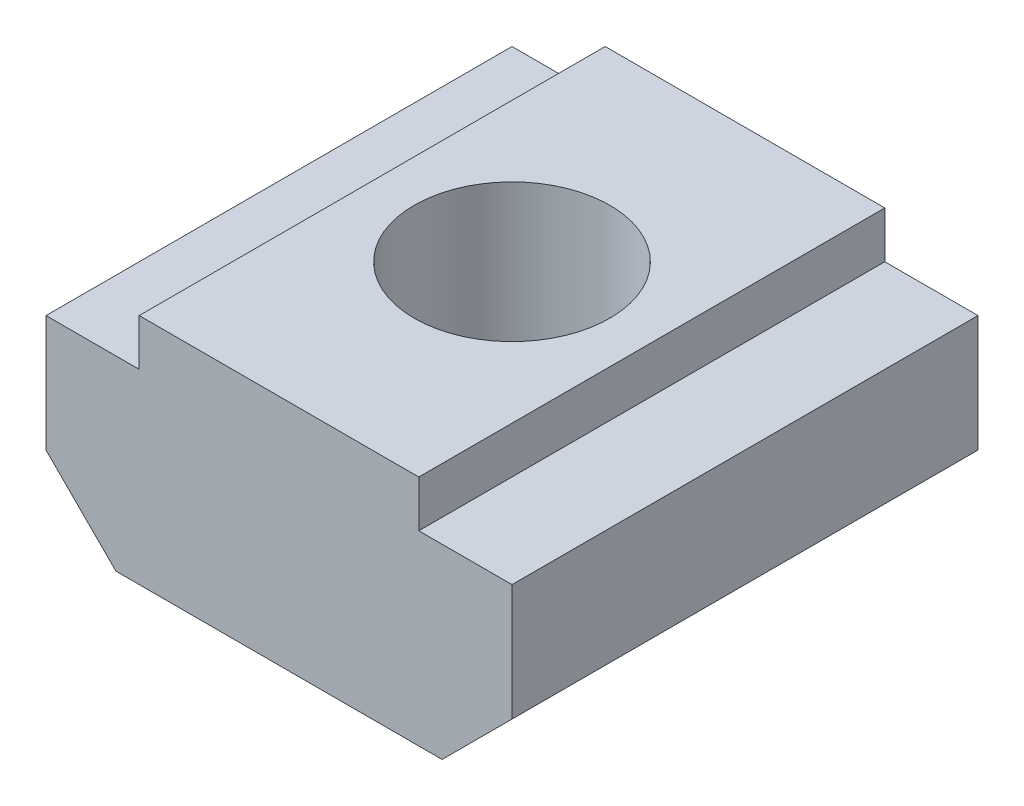
ISO-10303-21;
HEADER;
FILE_DESCRIPTION(('STEP AP214'),'2;1');
FILE_NAME('part.step','',(''),(''),'','','');
FILE_SCHEMA(('AUTOMOTIVE_DESIGN { 1 0 10303 214 1 1 1 1 }'));
ENDSEC;
DATA;
#1=APPLICATION_CONTEXT('core data for automotive mechanical design processes');
#2=APPLICATION_PROTOCOL_DEFINITION('international standard','automotive_design',2000,#1);
#3=PRODUCT_CONTEXT('',#1,'mechanical');
#4=PRODUCT('Part','Part','',(#3));
#5=PRODUCT_RELATED_PRODUCT_CATEGORY('part','',(#4));
#6=PRODUCT_DEFINITION_FORMATION('','',#4);
#7=PRODUCT_DEFINITION_CONTEXT('part definition',#1,'design');
#8=PRODUCT_DEFINITION('design','',#6,#7);
#9=PRODUCT_DEFINITION_SHAPE('','',#8);
#10=(LENGTH_UNIT() NAMED_UNIT(*) SI_UNIT(.MILLI.,.METRE.));
#11=(NAMED_UNIT(*) PLANE_ANGLE_UNIT() SI_UNIT($,.RADIAN.));
#12=(NAMED_UNIT(*) SI_UNIT($,.STERADIAN.) SOLID_ANGLE_UNIT());
#13=UNCERTAINTY_MEASURE_WITH_UNIT(LENGTH_MEASURE(1.E-05),#10,'distance_accuracy_value','');
#14=(GEOMETRIC_REPRESENTATION_CONTEXT(3) GLOBAL_UNCERTAINTY_ASSIGNED_CONTEXT((#13)) GLOBAL_UNIT_ASSIGNED_CONTEXT((#10,
#11,#12)) REPRESENTATION_CONTEXT('',''));
#15=CARTESIAN_POINT('',(0.,0.,0.));
#16=DIRECTION('',(0.,0.,1.));
#17=DIRECTION('',(1.,0.,0.));
#18=AXIS2_PLACEMENT_3D('',#15,#16,#17);
#19=CARTESIAN_POINT('',(0.,1.5,5.));
#20=DIRECTION('',(0.,1.,0.));
#21=DIRECTION('',(0.,0.,1.));
#22=AXIS2_PLACEMENT_3D('',#19,#20,#21);
#23=PLANE('',#22);
#24=DIRECTION('',(1.,0.,0.));
#25=VECTOR('',#24,1.);
#26=CARTESIAN_POINT('',(0.,1.5,-5.));
#27=LINE('',#26,#25);
#28=CARTESIAN_POINT('',(-5.,1.5,-5.));
#29=VERTEX_POINT('',#28);
#30=CARTESIAN_POINT('',(-3.,1.5,-5.));
#31=VERTEX_POINT('',#30);
#32=EDGE_CURVE('E154',#29,#31,#27,.T.);
#33=ORIENTED_EDGE('',*,*,#32,.F.);
#34=DIRECTION('',(0.,0.,-1.));
#35=VECTOR('',#34,1.);
#36=CARTESIAN_POINT('',(-5.,1.5,5.));
#37=LINE('',#36,#35);
#38=CARTESIAN_POINT('',(-5.,1.5,5.));
#39=VERTEX_POINT('',#38);
#40=EDGE_CURVE('E11',#39,#29,#37,.T.);
#41=ORIENTED_EDGE('',*,*,#40,.F.);
#42=DIRECTION('',(1.,0.,0.));
#43=VECTOR('',#42,1.);
#44=CARTESIAN_POINT('',(0.,1.5,5.));
#45=LINE('',#44,#43);
#46=CARTESIAN_POINT('',(-3.,1.5,5.));
#47=VERTEX_POINT('',#46);
#48=EDGE_CURVE('E190',#39,#47,#45,.T.);
#49=ORIENTED_EDGE('',*,*,#48,.T.);
#50=DIRECTION('',(0.,0.,-1.));
#51=VECTOR('',#50,1.);
#52=CARTESIAN_POINT('',(-3.,1.5,5.));
#53=LINE('',#52,#51);
#54=EDGE_CURVE('E62',#47,#31,#53,.T.);
#55=ORIENTED_EDGE('',*,*,#54,.T.);
#56=EDGE_LOOP('',(#33,#41,#49,#55));
#57=FACE_BOUND('',#56,.T.);
#58=ADVANCED_FACE('F45',(#57),#23,.T.);
#59=CARTESIAN_POINT('',(-5.,0.,5.));
#60=DIRECTION('',(-1.,0.,0.));
#61=DIRECTION('',(0.,0.,1.));
#62=AXIS2_PLACEMENT_3D('',#59,#60,#61);
#63=PLANE('',#62);
#64=DIRECTION('',(0.,1.,0.));
#65=VECTOR('',#64,1.);
#66=CARTESIAN_POINT('',(-5.,0.,-5.));
#67=LINE('',#66,#65);
#68=CARTESIAN_POINT('',(-5.,-1.00000000000001,-5.));
#69=VERTEX_POINT('',#68);
#70=EDGE_CURVE('E157',#69,#29,#67,.T.);
#71=ORIENTED_EDGE('',*,*,#70,.F.);
#72=DIRECTION('',(0.,0.,-1.));
#73=VECTOR('',#72,1.);
#74=CARTESIAN_POINT('',(-5.,-1.00000000000001,5.));
#75=LINE('',#74,#73);
#76=CARTESIAN_POINT('',(-5.,-1.00000000000001,5.));
#77=VERTEX_POINT('',#76);
#78=EDGE_CURVE('E54',#77,#69,#75,.T.);
#79=ORIENTED_EDGE('',*,*,#78,.F.);
#80=DIRECTION('',(0.,1.,0.));
#81=VECTOR('',#80,1.);
#82=CARTESIAN_POINT('',(-5.,0.,5.));
#83=LINE('',#82,#81);
#84=EDGE_CURVE('E224',#77,#39,#83,.T.);
#85=ORIENTED_EDGE('',*,*,#84,.T.);
#86=ORIENTED_EDGE('',*,*,#40,.T.);
#87=EDGE_LOOP('',(#71,#79,#85,#86));
#88=FACE_BOUND('',#87,.T.);
#89=ADVANCED_FACE('F223',(#88),#63,.T.);
#90=CARTESIAN_POINT('',(-2.99999999999998,-3.00000000000001,5.));
#91=DIRECTION('',(0.707106781186544,0.707106781186551,0.));
#92=DIRECTION('',(-0.707106781186551,0.707106781186544,0.));
#93=AXIS2_PLACEMENT_3D('',#90,#91,#92);
#94=PLANE('',#93);
#95=DIRECTION('',(0.707106781186551,-0.707106781186544,0.));
#96=VECTOR('',#95,1.);
#97=CARTESIAN_POINT('',(-2.99999999999998,-3.00000000000001,-5.));
#98=LINE('',#97,#96);
#99=CARTESIAN_POINT('',(-3.5,-2.5,-5.));
#100=VERTEX_POINT('',#99);
#101=EDGE_CURVE('E162',#69,#100,#98,.T.);
#102=ORIENTED_EDGE('',*,*,#101,.T.);
#103=DIRECTION('',(0.,0.,-1.));
#104=VECTOR('',#103,1.);
#105=CARTESIAN_POINT('',(-3.5,-2.5,5.));
#106=LINE('',#105,#104);
#107=CARTESIAN_POINT('',(-3.5,-2.5,5.));
#108=VERTEX_POINT('',#107);
#109=EDGE_CURVE('E206',#108,#100,#106,.T.);
#110=ORIENTED_EDGE('',*,*,#109,.F.);
#111=DIRECTION('',(0.707106781186551,-0.707106781186544,0.));
#112=VECTOR('',#111,1.);
#113=CARTESIAN_POINT('',(-2.99999999999998,-3.00000000000001,5.));
#114=LINE('',#113,#112);
#115=EDGE_CURVE('E215',#77,#108,#114,.T.);
#116=ORIENTED_EDGE('',*,*,#115,.F.);
#117=ORIENTED_EDGE('',*,*,#78,.T.);
#118=EDGE_LOOP('',(#102,#110,#116,#117));
#119=FACE_BOUND('',#118,.T.);
#120=ADVANCED_FACE('F213',(#119),#94,.F.);
#121=CARTESIAN_POINT('',(0.,-2.5,5.));
#122=DIRECTION('',(0.,1.,0.));
#123=DIRECTION('',(0.,0.,1.));
#124=AXIS2_PLACEMENT_3D('',#121,#122,#123);
#125=PLANE('',#124);
#126=CARTESIAN_POINT('',(0.,-2.5,0.));
#127=DIRECTION('',(0.,1.,0.));
#128=DIRECTION('',(0.,0.,1.));
#129=AXIS2_PLACEMENT_3D('',#126,#127,#128);
#130=CIRCLE('',#129,2.1);
#131=CARTESIAN_POINT('',(0.,-2.5,2.1));
#132=VERTEX_POINT('',#131);
#133=EDGE_CURVE('E158',#132,#132,#130,.T.);
#134=ORIENTED_EDGE('',*,*,#133,.T.);
#135=EDGE_LOOP('',(#134));
#136=FACE_BOUND('',#135,.T.);
#137=DIRECTION('',(1.,0.,0.));
#138=VECTOR('',#137,1.);
#139=CARTESIAN_POINT('',(0.,-2.5,-5.));
#140=LINE('',#139,#138);
#141=CARTESIAN_POINT('',(3.5,-2.5,-5.));
#142=VERTEX_POINT('',#141);
#143=EDGE_CURVE('E165',#100,#142,#140,.T.);
#144=ORIENTED_EDGE('',*,*,#143,.T.);
#145=DIRECTION('',(0.,0.,-1.));
#146=VECTOR('',#145,1.);
#147=CARTESIAN_POINT('',(3.5,-2.5,5.));
#148=LINE('',#147,#146);
#149=CARTESIAN_POINT('',(3.5,-2.5,5.));
#150=VERTEX_POINT('',#149);
#151=EDGE_CURVE('E203',#150,#142,#148,.T.);
#152=ORIENTED_EDGE('',*,*,#151,.F.);
#153=DIRECTION('',(1.,0.,0.));
#154=VECTOR('',#153,1.);
#155=CARTESIAN_POINT('',(0.,-2.5,5.));
#156=LINE('',#155,#154);
#157=EDGE_CURVE('E403',#108,#150,#156,.T.);
#158=ORIENTED_EDGE('',*,*,#157,.F.);
#159=ORIENTED_EDGE('',*,*,#109,.T.);
#160=EDGE_LOOP('',(#144,#152,#158,#159));
#161=FACE_BOUND('',#160,.T.);
#162=ADVANCED_FACE('F243',(#136,#161),#125,.F.);
#163=CARTESIAN_POINT('',(2.99999999999998,-3.00000000000001,5.));
#164=DIRECTION('',(0.707106781186544,-0.707106781186551,0.));
#165=DIRECTION('',(0.707106781186551,0.707106781186544,0.));
#166=AXIS2_PLACEMENT_3D('',#163,#164,#165);
#167=PLANE('',#166);
#168=DIRECTION('',(-0.707106781186551,-0.707106781186544,0.));
#169=VECTOR('',#168,1.);
#170=CARTESIAN_POINT('',(2.99999999999998,-3.00000000000001,-5.));
#171=LINE('',#170,#169);
#172=CARTESIAN_POINT('',(5.,-1.00000000000001,-5.));
#173=VERTEX_POINT('',#172);
#174=EDGE_CURVE('E169',#173,#142,#171,.T.);
#175=ORIENTED_EDGE('',*,*,#174,.F.);
#176=DIRECTION('',(0.,0.,-1.));
#177=VECTOR('',#176,1.);
#178=CARTESIAN_POINT('',(5.,-1.00000000000001,5.));
#179=LINE('',#178,#177);
#180=CARTESIAN_POINT('',(5.,-1.00000000000001,5.));
#181=VERTEX_POINT('',#180);
#182=EDGE_CURVE('E200',#181,#173,#179,.T.);
#183=ORIENTED_EDGE('',*,*,#182,.F.);
#184=DIRECTION('',(-0.707106781186551,-0.707106781186544,0.));
#185=VECTOR('',#184,1.);
#186=CARTESIAN_POINT('',(2.99999999999998,-3.00000000000001,5.));
#187=LINE('',#186,#185);
#188=EDGE_CURVE('E406',#181,#150,#187,.T.);
#189=ORIENTED_EDGE('',*,*,#188,.T.);
#190=ORIENTED_EDGE('',*,*,#151,.T.);
#191=EDGE_LOOP('',(#175,#183,#189,#190));
#192=FACE_BOUND('',#191,.T.);
#193=ADVANCED_FACE('F248',(#192),#167,.T.);
#194=CARTESIAN_POINT('',(5.,0.,5.));
#195=DIRECTION('',(-1.,0.,0.));
#196=DIRECTION('',(0.,0.,1.));
#197=AXIS2_PLACEMENT_3D('',#194,#195,#196);
#198=PLANE('',#197);
#199=DIRECTION('',(0.,1.,0.));
#200=VECTOR('',#199,1.);
#201=CARTESIAN_POINT('',(5.,0.,-5.));
#202=LINE('',#201,#200);
#203=CARTESIAN_POINT('',(5.,1.5,-5.));
#204=VERTEX_POINT('',#203);
#205=EDGE_CURVE('E173',#173,#204,#202,.T.);
#206=ORIENTED_EDGE('',*,*,#205,.T.);
#207=DIRECTION('',(0.,0.,-1.));
#208=VECTOR('',#207,1.);
#209=CARTESIAN_POINT('',(5.,1.5,5.));
#210=LINE('',#209,#208);
#211=CARTESIAN_POINT('',(5.,1.5,5.));
#212=VERTEX_POINT('',#211);
#213=EDGE_CURVE('E197',#212,#204,#210,.T.);
#214=ORIENTED_EDGE('',*,*,#213,.F.);
#215=DIRECTION('',(0.,1.,0.));
#216=VECTOR('',#215,1.);
#217=CARTESIAN_POINT('',(5.,0.,5.));
#218=LINE('',#217,#216);
#219=EDGE_CURVE('E410',#181,#212,#218,.T.);
#220=ORIENTED_EDGE('',*,*,#219,.F.);
#221=ORIENTED_EDGE('',*,*,#182,.T.);
#222=EDGE_LOOP('',(#206,#214,#220,#221));
#223=FACE_BOUND('',#222,.T.);
#224=ADVANCED_FACE('F252',(#223),#198,.F.);
#225=CARTESIAN_POINT('',(0.,1.5,5.));
#226=DIRECTION('',(0.,1.,0.));
#227=DIRECTION('',(0.,0.,1.));
#228=AXIS2_PLACEMENT_3D('',#225,#226,#227);
#229=PLANE('',#228);
#230=DIRECTION('',(1.,0.,0.));
#231=VECTOR('',#230,1.);
#232=CARTESIAN_POINT('',(0.,1.5,-5.));
#233=LINE('',#232,#231);
#234=CARTESIAN_POINT('',(3.,1.5,-5.));
#235=VERTEX_POINT('',#234);
#236=EDGE_CURVE('E177',#235,#204,#233,.T.);
#237=ORIENTED_EDGE('',*,*,#236,.F.);
#238=DIRECTION('',(0.,0.,-1.));
#239=VECTOR('',#238,1.);
#240=CARTESIAN_POINT('',(3.,1.5,5.));
#241=LINE('',#240,#239);
#242=CARTESIAN_POINT('',(3.,1.5,5.));
#243=VERTEX_POINT('',#242);
#244=EDGE_CURVE('E144',#243,#235,#241,.T.);
#245=ORIENTED_EDGE('',*,*,#244,.F.);
#246=DIRECTION('',(1.,0.,0.));
#247=VECTOR('',#246,1.);
#248=CARTESIAN_POINT('',(0.,1.5,5.));
#249=LINE('',#248,#247);
#250=EDGE_CURVE('E132',#243,#212,#249,.T.);
#251=ORIENTED_EDGE('',*,*,#250,.T.);
#252=ORIENTED_EDGE('',*,*,#213,.T.);
#253=EDGE_LOOP('',(#237,#245,#251,#252));
#254=FACE_BOUND('',#253,.T.);
#255=ADVANCED_FACE('F256',(#254),#229,.T.);
#256=CARTESIAN_POINT('',(3.,0.,5.));
#257=DIRECTION('',(-1.,0.,0.));
#258=DIRECTION('',(0.,0.,1.));
#259=AXIS2_PLACEMENT_3D('',#256,#257,#258);
#260=PLANE('',#259);
#261=DIRECTION('',(0.,1.,0.));
#262=VECTOR('',#261,1.);
#263=CARTESIAN_POINT('',(3.,0.,-5.));
#264=LINE('',#263,#262);
#265=CARTESIAN_POINT('',(3.,2.5,-5.));
#266=VERTEX_POINT('',#265);
#267=EDGE_CURVE('E140',#235,#266,#264,.T.);
#268=ORIENTED_EDGE('',*,*,#267,.T.);
#269=DIRECTION('',(0.,0.,-1.));
#270=VECTOR('',#269,1.);
#271=CARTESIAN_POINT('',(3.,2.5,5.));
#272=LINE('',#271,#270);
#273=CARTESIAN_POINT('',(3.,2.5,5.));
#274=VERTEX_POINT('',#273);
#275=EDGE_CURVE('E137',#274,#266,#272,.T.);
#276=ORIENTED_EDGE('',*,*,#275,.F.);
#277=DIRECTION('',(0.,1.,0.));
#278=VECTOR('',#277,1.);
#279=CARTESIAN_POINT('',(3.,0.,5.));
#280=LINE('',#279,#278);
#281=EDGE_CURVE('E125',#243,#274,#280,.T.);
#282=ORIENTED_EDGE('',*,*,#281,.F.);
#283=ORIENTED_EDGE('',*,*,#244,.T.);
#284=EDGE_LOOP('',(#268,#276,#282,#283));
#285=FACE_BOUND('',#284,.T.);
#286=ADVANCED_FACE('F138',(#285),#260,.F.);
#287=CARTESIAN_POINT('',(0.,2.5,5.));
#288=DIRECTION('',(0.,1.,0.));
#289=DIRECTION('',(0.,0.,1.));
#290=AXIS2_PLACEMENT_3D('',#287,#288,#289);
#291=PLANE('',#290);
#292=CARTESIAN_POINT('',(0.,2.5,0.));
#293=DIRECTION('',(0.,1.,0.));
#294=DIRECTION('',(0.,0.,1.));
#295=AXIS2_PLACEMENT_3D('',#292,#293,#294);
#296=CIRCLE('',#295,2.1);
#297=CARTESIAN_POINT('',(0.,2.5,2.1));
#298=VERTEX_POINT('',#297);
#299=EDGE_CURVE('E391',#298,#298,#296,.T.);
#300=ORIENTED_EDGE('',*,*,#299,.F.);
#301=EDGE_LOOP('',(#300));
#302=FACE_BOUND('',#301,.T.);
#303=DIRECTION('',(1.,0.,0.));
#304=VECTOR('',#303,1.);
#305=CARTESIAN_POINT('',(0.,2.5,-5.));
#306=LINE('',#305,#304);
#307=CARTESIAN_POINT('',(-3.,2.5,-5.));
#308=VERTEX_POINT('',#307);
#309=EDGE_CURVE('E183',#308,#266,#306,.T.);
#310=ORIENTED_EDGE('',*,*,#309,.F.);
#311=DIRECTION('',(0.,0.,-1.));
#312=VECTOR('',#311,1.);
#313=CARTESIAN_POINT('',(-3.,2.5,5.));
#314=LINE('',#313,#312);
#315=CARTESIAN_POINT('',(-3.,2.5,5.));
#316=VERTEX_POINT('',#315);
#317=EDGE_CURVE('E93',#316,#308,#314,.T.);
#318=ORIENTED_EDGE('',*,*,#317,.F.);
#319=DIRECTION('',(1.,0.,0.));
#320=VECTOR('',#319,1.);
#321=CARTESIAN_POINT('',(0.,2.5,5.));
#322=LINE('',#321,#320);
#323=EDGE_CURVE('E130',#316,#274,#322,.T.);
#324=ORIENTED_EDGE('',*,*,#323,.T.);
#325=ORIENTED_EDGE('',*,*,#275,.T.);
#326=EDGE_LOOP('',(#310,#318,#324,#325));
#327=FACE_BOUND('',#326,.T.);
#328=ADVANCED_FACE('F146',(#302,#327),#291,.T.);
#329=CARTESIAN_POINT('',(-3.,0.,5.));
#330=DIRECTION('',(-1.,0.,0.));
#331=DIRECTION('',(0.,0.,1.));
#332=AXIS2_PLACEMENT_3D('',#329,#330,#331);
#333=PLANE('',#332);
#334=DIRECTION('',(0.,1.,0.));
#335=VECTOR('',#334,1.);
#336=CARTESIAN_POINT('',(-3.,0.,-5.));
#337=LINE('',#336,#335);
#338=EDGE_CURVE('E186',#31,#308,#337,.T.);
#339=ORIENTED_EDGE('',*,*,#338,.F.);
#340=ORIENTED_EDGE('',*,*,#54,.F.);
#341=DIRECTION('',(0.,1.,0.));
#342=VECTOR('',#341,1.);
#343=CARTESIAN_POINT('',(-3.,0.,5.));
#344=LINE('',#343,#342);
#345=EDGE_CURVE('E148',#47,#316,#344,.T.);
#346=ORIENTED_EDGE('',*,*,#345,.T.);
#347=ORIENTED_EDGE('',*,*,#317,.T.);
#348=EDGE_LOOP('',(#339,#340,#346,#347));
#349=FACE_BOUND('',#348,.T.);
#350=ADVANCED_FACE('F225',(#349),#333,.T.);
#351=CARTESIAN_POINT('',(0.,0.,5.));
#352=DIRECTION('',(0.,0.,1.));
#353=DIRECTION('',(1.,0.,0.));
#354=AXIS2_PLACEMENT_3D('',#351,#352,#353);
#355=PLANE('',#354);
#356=ORIENTED_EDGE('',*,*,#48,.F.);
#357=ORIENTED_EDGE('',*,*,#84,.F.);
#358=ORIENTED_EDGE('',*,*,#115,.T.);
#359=ORIENTED_EDGE('',*,*,#157,.T.);
#360=ORIENTED_EDGE('',*,*,#188,.F.);
#361=ORIENTED_EDGE('',*,*,#219,.T.);
#362=ORIENTED_EDGE('',*,*,#250,.F.);
#363=ORIENTED_EDGE('',*,*,#281,.T.);
#364=ORIENTED_EDGE('',*,*,#323,.F.);
#365=ORIENTED_EDGE('',*,*,#345,.F.);
#366=EDGE_LOOP('',(#356,#357,#358,#359,#360,#361,#362,#363,#364,#365));
#367=FACE_BOUND('',#366,.T.);
#368=ADVANCED_FACE('F127',(#367),#355,.T.);
#369=CARTESIAN_POINT('',(0.,0.,-5.));
#370=DIRECTION('',(0.,0.,1.));
#371=DIRECTION('',(1.,0.,0.));
#372=AXIS2_PLACEMENT_3D('',#369,#370,#371);
#373=PLANE('',#372);
#374=ORIENTED_EDGE('',*,*,#32,.T.);
#375=ORIENTED_EDGE('',*,*,#338,.T.);
#376=ORIENTED_EDGE('',*,*,#309,.T.);
#377=ORIENTED_EDGE('',*,*,#267,.F.);
#378=ORIENTED_EDGE('',*,*,#236,.T.);
#379=ORIENTED_EDGE('',*,*,#205,.F.);
#380=ORIENTED_EDGE('',*,*,#174,.T.);
#381=ORIENTED_EDGE('',*,*,#143,.F.);
#382=ORIENTED_EDGE('',*,*,#101,.F.);
#383=ORIENTED_EDGE('',*,*,#70,.T.);
#384=EDGE_LOOP('',(#374,#375,#376,#377,#378,#379,#380,#381,#382,#383));
#385=FACE_BOUND('',#384,.T.);
#386=ADVANCED_FACE('F222',(#385),#373,.F.);
#387=CARTESIAN_POINT('',(0.,-2.5,0.));
#388=DIRECTION('',(0.,1.,0.));
#389=DIRECTION('',(0.,0.,1.));
#390=AXIS2_PLACEMENT_3D('',#387,#388,#389);
#391=CYLINDRICAL_SURFACE('',#390,2.1);
#392=ORIENTED_EDGE('',*,*,#133,.F.);
#393=EDGE_LOOP('',(#392));
#394=FACE_BOUND('',#393,.T.);
#395=ORIENTED_EDGE('',*,*,#299,.T.);
#396=EDGE_LOOP('',(#395));
#397=FACE_BOUND('',#396,.T.);
#398=ADVANCED_FACE('F281',(#394,#397),#391,.F.);
#399=CLOSED_SHELL('',(#58,#89,#120,#162,#193,#224,#255,#286,#328,#350,#368,#386,#398));
#400=MANIFOLD_SOLID_BREP('B2',#399);
#401=ADVANCED_BREP_SHAPE_REPRESENTATION('',(#18,#400),#14);
#402=SHAPE_DEFINITION_REPRESENTATION(#9,#401);
ENDSEC;
END-ISO-10303-21;
